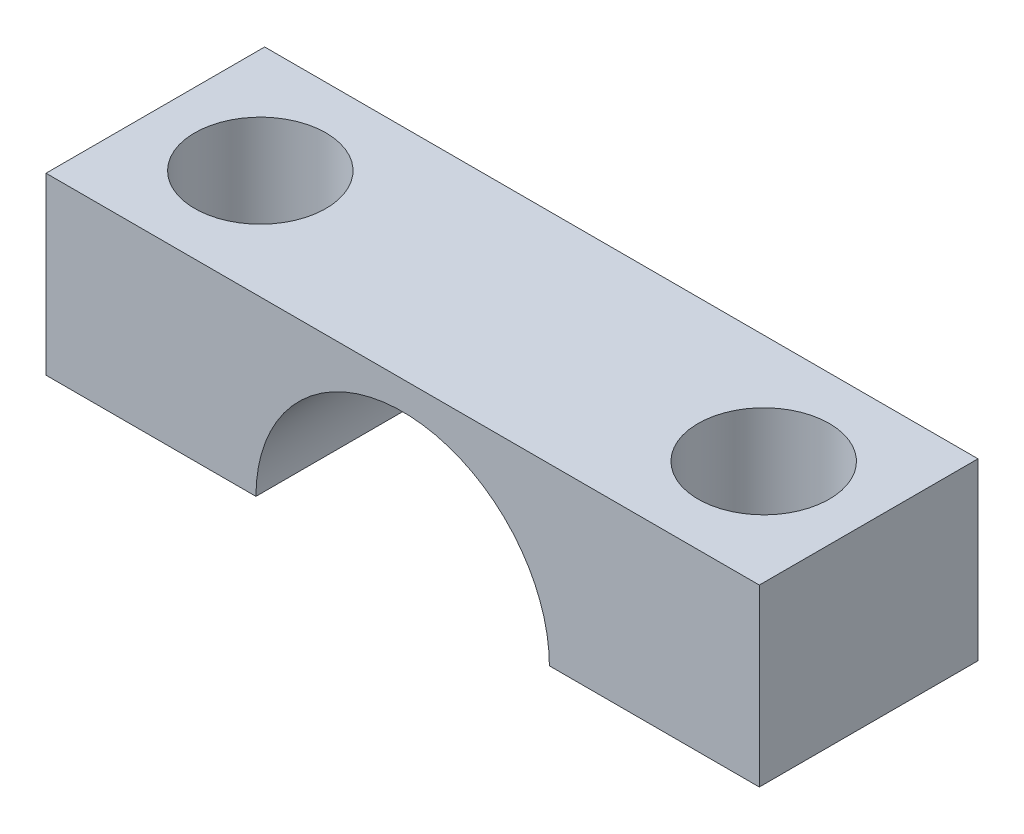
ISO-10303-21;
HEADER;
FILE_DESCRIPTION(('STEP AP214'),'2;1');
FILE_NAME('part.step','',(''),(''),'','','');
FILE_SCHEMA(('AUTOMOTIVE_DESIGN { 1 0 10303 214 1 1 1 1 }'));
ENDSEC;
DATA;
#1=APPLICATION_CONTEXT('core data for automotive mechanical design processes');
#2=APPLICATION_PROTOCOL_DEFINITION('international standard','automotive_design',2000,#1);
#3=PRODUCT_CONTEXT('',#1,'mechanical');
#4=PRODUCT('Part','Part','',(#3));
#5=PRODUCT_RELATED_PRODUCT_CATEGORY('part','',(#4));
#6=PRODUCT_DEFINITION_FORMATION('','',#4);
#7=PRODUCT_DEFINITION_CONTEXT('part definition',#1,'design');
#8=PRODUCT_DEFINITION('design','',#6,#7);
#9=PRODUCT_DEFINITION_SHAPE('','',#8);
#10=(LENGTH_UNIT() NAMED_UNIT(*) SI_UNIT(.MILLI.,.METRE.));
#11=(NAMED_UNIT(*) PLANE_ANGLE_UNIT() SI_UNIT($,.RADIAN.));
#12=(NAMED_UNIT(*) SI_UNIT($,.STERADIAN.) SOLID_ANGLE_UNIT());
#13=UNCERTAINTY_MEASURE_WITH_UNIT(LENGTH_MEASURE(1.E-05),#10,'distance_accuracy_value','');
#14=(GEOMETRIC_REPRESENTATION_CONTEXT(3) GLOBAL_UNCERTAINTY_ASSIGNED_CONTEXT((#13)) GLOBAL_UNIT_ASSIGNED_CONTEXT((#10,
#11,#12)) REPRESENTATION_CONTEXT('',''));
#15=CARTESIAN_POINT('',(0.,0.,0.));
#16=DIRECTION('',(0.,0.,1.));
#17=DIRECTION('',(1.,0.,0.));
#18=AXIS2_PLACEMENT_3D('',#15,#16,#17);
#19=CARTESIAN_POINT('',(-8.155,-2.,-5.));
#20=DIRECTION('',(0.,-1.,0.));
#21=DIRECTION('',(0.,0.,-1.));
#22=AXIS2_PLACEMENT_3D('',#19,#20,#21);
#23=PLANE('',#22);
#24=CARTESIAN_POINT('',(5.755,-2.,-2.5));
#25=DIRECTION('',(0.,-1.,0.));
#26=DIRECTION('',(0.,0.,-1.));
#27=AXIS2_PLACEMENT_3D('',#24,#25,#26);
#28=CIRCLE('',#27,1.5);
#29=CARTESIAN_POINT('',(5.755,-2.,-4.));
#30=VERTEX_POINT('',#29);
#31=EDGE_CURVE('E135',#30,#30,#28,.F.);
#32=ORIENTED_EDGE('',*,*,#31,.T.);
#33=EDGE_LOOP('',(#32));
#34=FACE_BOUND('',#33,.T.);
#35=DIRECTION('',(0.,0.,1.));
#36=VECTOR('',#35,1.);
#37=CARTESIAN_POINT('',(3.355,-2.,-5.));
#38=LINE('',#37,#36);
#39=CARTESIAN_POINT('',(3.355,-2.,-5.));
#40=VERTEX_POINT('',#39);
#41=CARTESIAN_POINT('',(3.355,-2.,0.));
#42=VERTEX_POINT('',#41);
#43=EDGE_CURVE('E52',#40,#42,#38,.T.);
#44=ORIENTED_EDGE('',*,*,#43,.F.);
#45=DIRECTION('',(1.,0.,0.));
#46=VECTOR('',#45,1.);
#47=CARTESIAN_POINT('',(-8.155,-2.,-5.));
#48=LINE('',#47,#46);
#49=CARTESIAN_POINT('',(8.155,-2.,-5.));
#50=VERTEX_POINT('',#49);
#51=EDGE_CURVE('E84',#40,#50,#48,.T.);
#52=ORIENTED_EDGE('',*,*,#51,.T.);
#53=DIRECTION('',(0.,0.,1.));
#54=VECTOR('',#53,1.);
#55=CARTESIAN_POINT('',(8.155,-2.,-5.));
#56=LINE('',#55,#54);
#57=CARTESIAN_POINT('',(8.155,-2.,0.));
#58=VERTEX_POINT('',#57);
#59=EDGE_CURVE('E118',#50,#58,#56,.T.);
#60=ORIENTED_EDGE('',*,*,#59,.T.);
#61=DIRECTION('',(1.,0.,0.));
#62=VECTOR('',#61,1.);
#63=CARTESIAN_POINT('',(-8.155,-2.,0.));
#64=LINE('',#63,#62);
#65=EDGE_CURVE('E122',#42,#58,#64,.T.);
#66=ORIENTED_EDGE('',*,*,#65,.F.);
#67=EDGE_LOOP('',(#44,#52,#60,#66));
#68=FACE_BOUND('',#67,.T.);
#69=ADVANCED_FACE('F35',(#34,#68),#23,.T.);
#70=CARTESIAN_POINT('',(-5.755,-2.,-2.5));
#71=DIRECTION('',(0.,-1.,0.));
#72=DIRECTION('',(0.,0.,-1.));
#73=AXIS2_PLACEMENT_3D('',#70,#71,#72);
#74=CIRCLE('',#73,1.5);
#75=CARTESIAN_POINT('',(-5.755,-2.,-4.));
#76=VERTEX_POINT('',#75);
#77=EDGE_CURVE('E143',#76,#76,#74,.F.);
#78=ORIENTED_EDGE('',*,*,#77,.T.);
#79=EDGE_LOOP('',(#78));
#80=FACE_BOUND('',#79,.T.);
#81=DIRECTION('',(0.,0.,1.));
#82=VECTOR('',#81,1.);
#83=CARTESIAN_POINT('',(-3.355,-2.,-5.));
#84=LINE('',#83,#82);
#85=CARTESIAN_POINT('',(-3.355,-2.,-5.));
#86=VERTEX_POINT('',#85);
#87=CARTESIAN_POINT('',(-3.355,-2.,0.));
#88=VERTEX_POINT('',#87);
#89=EDGE_CURVE('E94',#86,#88,#84,.T.);
#90=ORIENTED_EDGE('',*,*,#89,.T.);
#91=CARTESIAN_POINT('',(-8.155,-2.,0.));
#92=VERTEX_POINT('',#91);
#93=EDGE_CURVE('E119',#92,#88,#64,.T.);
#94=ORIENTED_EDGE('',*,*,#93,.F.);
#95=DIRECTION('',(0.,0.,1.));
#96=VECTOR('',#95,1.);
#97=CARTESIAN_POINT('',(-8.155,-2.,-5.));
#98=LINE('',#97,#96);
#99=CARTESIAN_POINT('',(-8.155,-2.,-5.));
#100=VERTEX_POINT('',#99);
#101=EDGE_CURVE('E11',#100,#92,#98,.T.);
#102=ORIENTED_EDGE('',*,*,#101,.F.);
#103=EDGE_CURVE('E104',#100,#86,#48,.T.);
#104=ORIENTED_EDGE('',*,*,#103,.T.);
#105=EDGE_LOOP('',(#90,#94,#102,#104));
#106=FACE_BOUND('',#105,.T.);
#107=ADVANCED_FACE('F37',(#80,#106),#23,.T.);
#108=CARTESIAN_POINT('',(-8.155,-2.,-5.));
#109=DIRECTION('',(1.,0.,0.));
#110=DIRECTION('',(0.,0.,-1.));
#111=AXIS2_PLACEMENT_3D('',#108,#109,#110);
#112=PLANE('',#111);
#113=DIRECTION('',(0.,1.,0.));
#114=VECTOR('',#113,1.);
#115=CARTESIAN_POINT('',(-8.155,-2.,0.));
#116=LINE('',#115,#114);
#117=CARTESIAN_POINT('',(-8.155,2.,0.));
#118=VERTEX_POINT('',#117);
#119=EDGE_CURVE('E112',#92,#118,#116,.T.);
#120=ORIENTED_EDGE('',*,*,#119,.T.);
#121=DIRECTION('',(0.,0.,1.));
#122=VECTOR('',#121,1.);
#123=CARTESIAN_POINT('',(-8.155,2.,-5.));
#124=LINE('',#123,#122);
#125=CARTESIAN_POINT('',(-8.155,2.,-5.));
#126=VERTEX_POINT('',#125);
#127=EDGE_CURVE('E44',#126,#118,#124,.T.);
#128=ORIENTED_EDGE('',*,*,#127,.F.);
#129=DIRECTION('',(0.,1.,0.));
#130=VECTOR('',#129,1.);
#131=CARTESIAN_POINT('',(-8.155,-2.,-5.));
#132=LINE('',#131,#130);
#133=EDGE_CURVE('E116',#100,#126,#132,.T.);
#134=ORIENTED_EDGE('',*,*,#133,.F.);
#135=ORIENTED_EDGE('',*,*,#101,.T.);
#136=EDGE_LOOP('',(#120,#128,#134,#135));
#137=FACE_BOUND('',#136,.T.);
#138=ADVANCED_FACE('F159',(#137),#112,.F.);
#139=CARTESIAN_POINT('',(-8.155,2.,-5.));
#140=DIRECTION('',(0.,-1.,0.));
#141=DIRECTION('',(0.,0.,-1.));
#142=AXIS2_PLACEMENT_3D('',#139,#140,#141);
#143=PLANE('',#142);
#144=CARTESIAN_POINT('',(-5.755,2.,-2.5));
#145=DIRECTION('',(0.,-1.,0.));
#146=DIRECTION('',(0.,0.,-1.));
#147=AXIS2_PLACEMENT_3D('',#144,#145,#146);
#148=CIRCLE('',#147,1.5);
#149=CARTESIAN_POINT('',(-5.755,2.,-4.));
#150=VERTEX_POINT('',#149);
#151=EDGE_CURVE('E39',#150,#150,#148,.F.);
#152=ORIENTED_EDGE('',*,*,#151,.F.);
#153=EDGE_LOOP('',(#152));
#154=FACE_BOUND('',#153,.T.);
#155=CARTESIAN_POINT('',(5.755,2.,-2.5));
#156=DIRECTION('',(0.,-1.,0.));
#157=DIRECTION('',(0.,0.,-1.));
#158=AXIS2_PLACEMENT_3D('',#155,#156,#157);
#159=CIRCLE('',#158,1.5);
#160=CARTESIAN_POINT('',(5.755,2.,-4.));
#161=VERTEX_POINT('',#160);
#162=EDGE_CURVE('E133',#161,#161,#159,.F.);
#163=ORIENTED_EDGE('',*,*,#162,.F.);
#164=EDGE_LOOP('',(#163));
#165=FACE_BOUND('',#164,.T.);
#166=DIRECTION('',(1.,0.,0.));
#167=VECTOR('',#166,1.);
#168=CARTESIAN_POINT('',(-8.155,2.,0.));
#169=LINE('',#168,#167);
#170=CARTESIAN_POINT('',(8.155,2.,0.));
#171=VERTEX_POINT('',#170);
#172=EDGE_CURVE('E125',#118,#171,#169,.T.);
#173=ORIENTED_EDGE('',*,*,#172,.T.);
#174=DIRECTION('',(0.,0.,1.));
#175=VECTOR('',#174,1.);
#176=CARTESIAN_POINT('',(8.155,2.,-5.));
#177=LINE('',#176,#175);
#178=CARTESIAN_POINT('',(8.155,2.,-5.));
#179=VERTEX_POINT('',#178);
#180=EDGE_CURVE('E131',#179,#171,#177,.T.);
#181=ORIENTED_EDGE('',*,*,#180,.F.);
#182=DIRECTION('',(1.,0.,0.));
#183=VECTOR('',#182,1.);
#184=CARTESIAN_POINT('',(-8.155,2.,-5.));
#185=LINE('',#184,#183);
#186=EDGE_CURVE('E110',#126,#179,#185,.T.);
#187=ORIENTED_EDGE('',*,*,#186,.F.);
#188=ORIENTED_EDGE('',*,*,#127,.T.);
#189=EDGE_LOOP('',(#173,#181,#187,#188));
#190=FACE_BOUND('',#189,.T.);
#191=ADVANCED_FACE('F157',(#154,#165,#190),#143,.F.);
#192=CARTESIAN_POINT('',(8.155,-2.,-5.));
#193=DIRECTION('',(1.,0.,0.));
#194=DIRECTION('',(0.,0.,-1.));
#195=AXIS2_PLACEMENT_3D('',#192,#193,#194);
#196=PLANE('',#195);
#197=DIRECTION('',(0.,1.,0.));
#198=VECTOR('',#197,1.);
#199=CARTESIAN_POINT('',(8.155,-2.,0.));
#200=LINE('',#199,#198);
#201=EDGE_CURVE('E121',#58,#171,#200,.T.);
#202=ORIENTED_EDGE('',*,*,#201,.F.);
#203=ORIENTED_EDGE('',*,*,#59,.F.);
#204=DIRECTION('',(0.,1.,0.));
#205=VECTOR('',#204,1.);
#206=CARTESIAN_POINT('',(8.155,-2.,-5.));
#207=LINE('',#206,#205);
#208=EDGE_CURVE('E107',#50,#179,#207,.T.);
#209=ORIENTED_EDGE('',*,*,#208,.T.);
#210=ORIENTED_EDGE('',*,*,#180,.T.);
#211=EDGE_LOOP('',(#202,#203,#209,#210));
#212=FACE_BOUND('',#211,.T.);
#213=ADVANCED_FACE('F153',(#212),#196,.T.);
#214=CARTESIAN_POINT('',(0.,0.,-5.));
#215=DIRECTION('',(0.,0.,1.));
#216=DIRECTION('',(1.,0.,0.));
#217=AXIS2_PLACEMENT_3D('',#214,#215,#216);
#218=PLANE('',#217);
#219=ORIENTED_EDGE('',*,*,#51,.F.);
#220=CARTESIAN_POINT('',(0.,-2.,-5.));
#221=DIRECTION('',(0.,0.,1.));
#222=DIRECTION('',(1.,0.,0.));
#223=AXIS2_PLACEMENT_3D('',#220,#221,#222);
#224=CIRCLE('',#223,3.355);
#225=EDGE_CURVE('E97',#40,#86,#224,.T.);
#226=ORIENTED_EDGE('',*,*,#225,.T.);
#227=ORIENTED_EDGE('',*,*,#103,.F.);
#228=ORIENTED_EDGE('',*,*,#133,.T.);
#229=ORIENTED_EDGE('',*,*,#186,.T.);
#230=ORIENTED_EDGE('',*,*,#208,.F.);
#231=EDGE_LOOP('',(#219,#226,#227,#228,#229,#230));
#232=FACE_BOUND('',#231,.T.);
#233=ADVANCED_FACE('F103',(#232),#218,.F.);
#234=CARTESIAN_POINT('',(0.,0.,0.));
#235=DIRECTION('',(0.,0.,1.));
#236=DIRECTION('',(1.,0.,0.));
#237=AXIS2_PLACEMENT_3D('',#234,#235,#236);
#238=PLANE('',#237);
#239=CARTESIAN_POINT('',(0.,-2.,0.));
#240=DIRECTION('',(0.,0.,1.));
#241=DIRECTION('',(1.,0.,0.));
#242=AXIS2_PLACEMENT_3D('',#239,#240,#241);
#243=CIRCLE('',#242,3.355);
#244=EDGE_CURVE('E98',#42,#88,#243,.T.);
#245=ORIENTED_EDGE('',*,*,#244,.F.);
#246=ORIENTED_EDGE('',*,*,#65,.T.);
#247=ORIENTED_EDGE('',*,*,#201,.T.);
#248=ORIENTED_EDGE('',*,*,#172,.F.);
#249=ORIENTED_EDGE('',*,*,#119,.F.);
#250=ORIENTED_EDGE('',*,*,#93,.T.);
#251=EDGE_LOOP('',(#245,#246,#247,#248,#249,#250));
#252=FACE_BOUND('',#251,.T.);
#253=ADVANCED_FACE('F149',(#252),#238,.T.);
#254=CARTESIAN_POINT('',(0.,-2.,-5.));
#255=DIRECTION('',(0.,0.,1.));
#256=DIRECTION('',(1.,0.,0.));
#257=AXIS2_PLACEMENT_3D('',#254,#255,#256);
#258=CYLINDRICAL_SURFACE('',#257,3.355);
#259=ORIENTED_EDGE('',*,*,#244,.T.);
#260=ORIENTED_EDGE('',*,*,#89,.F.);
#261=ORIENTED_EDGE('',*,*,#225,.F.);
#262=ORIENTED_EDGE('',*,*,#43,.T.);
#263=EDGE_LOOP('',(#259,#260,#261,#262));
#264=FACE_BOUND('',#263,.T.);
#265=ADVANCED_FACE('F96',(#264),#258,.F.);
#266=CARTESIAN_POINT('',(5.755,2.5,-2.5));
#267=DIRECTION('',(0.,-1.,0.));
#268=DIRECTION('',(0.,0.,-1.));
#269=AXIS2_PLACEMENT_3D('',#266,#267,#268);
#270=CYLINDRICAL_SURFACE('',#269,1.5);
#271=ORIENTED_EDGE('',*,*,#31,.F.);
#272=EDGE_LOOP('',(#271));
#273=FACE_BOUND('',#272,.T.);
#274=ORIENTED_EDGE('',*,*,#162,.T.);
#275=EDGE_LOOP('',(#274));
#276=FACE_BOUND('',#275,.T.);
#277=ADVANCED_FACE('F192',(#273,#276),#270,.F.);
#278=CARTESIAN_POINT('',(-5.755,2.5,-2.5));
#279=DIRECTION('',(0.,-1.,0.));
#280=DIRECTION('',(0.,0.,-1.));
#281=AXIS2_PLACEMENT_3D('',#278,#279,#280);
#282=CYLINDRICAL_SURFACE('',#281,1.5);
#283=ORIENTED_EDGE('',*,*,#77,.F.);
#284=EDGE_LOOP('',(#283));
#285=FACE_BOUND('',#284,.T.);
#286=ORIENTED_EDGE('',*,*,#151,.T.);
#287=EDGE_LOOP('',(#286));
#288=FACE_BOUND('',#287,.T.);
#289=ADVANCED_FACE('F197',(#285,#288),#282,.F.);
#290=CLOSED_SHELL('',(#69,#107,#138,#191,#213,#233,#253,#265,#277,#289));
#291=MANIFOLD_SOLID_BREP('B2',#290);
#292=ADVANCED_BREP_SHAPE_REPRESENTATION('',(#18,#291),#14);
#293=SHAPE_DEFINITION_REPRESENTATION(#9,#292);
ENDSEC;
END-ISO-10303-21;
